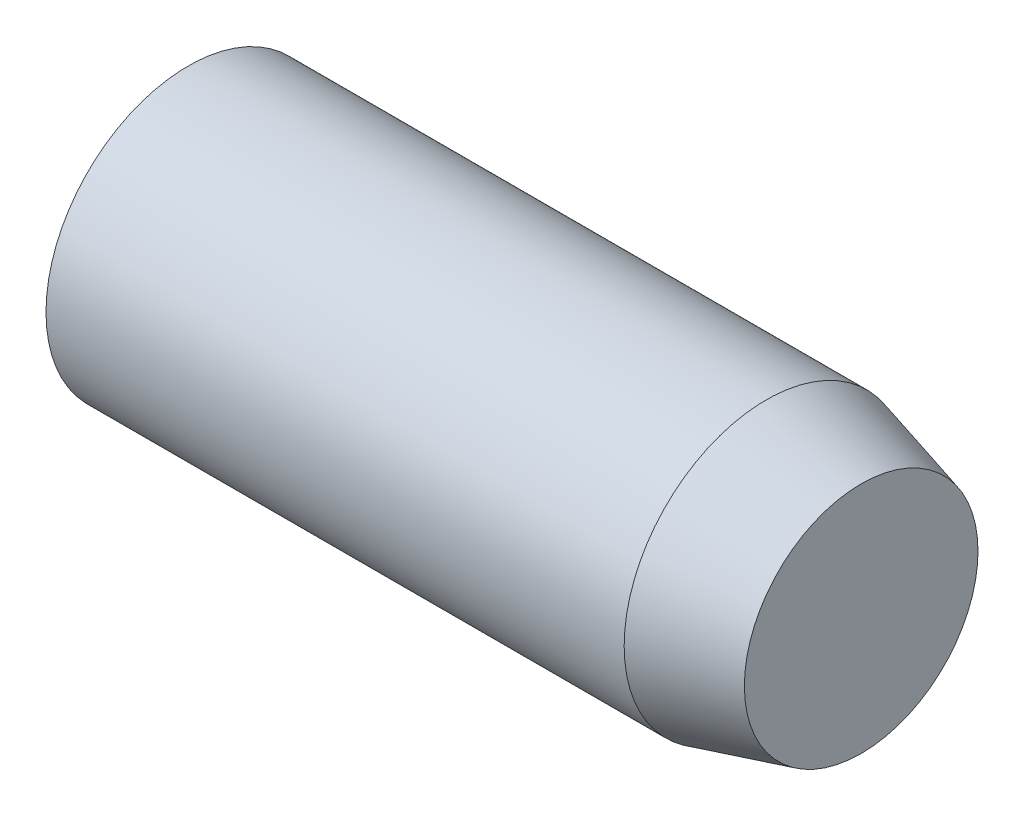
ISO-10303-21;
HEADER;
FILE_DESCRIPTION(('STEP AP214'),'2;1');
FILE_NAME('part.step','',(''),(''),'','','');
FILE_SCHEMA(('AUTOMOTIVE_DESIGN { 1 0 10303 214 1 1 1 1 }'));
ENDSEC;
DATA;
#1=APPLICATION_CONTEXT('core data for automotive mechanical design processes');
#2=APPLICATION_PROTOCOL_DEFINITION('international standard','automotive_design',2000,#1);
#3=PRODUCT_CONTEXT('',#1,'mechanical');
#4=PRODUCT('Part','Part','',(#3));
#5=PRODUCT_RELATED_PRODUCT_CATEGORY('part','',(#4));
#6=PRODUCT_DEFINITION_FORMATION('','',#4);
#7=PRODUCT_DEFINITION_CONTEXT('part definition',#1,'design');
#8=PRODUCT_DEFINITION('design','',#6,#7);
#9=PRODUCT_DEFINITION_SHAPE('','',#8);
#10=(LENGTH_UNIT() NAMED_UNIT(*) SI_UNIT(.MILLI.,.METRE.));
#11=(NAMED_UNIT(*) PLANE_ANGLE_UNIT() SI_UNIT($,.RADIAN.));
#12=(NAMED_UNIT(*) SI_UNIT($,.STERADIAN.) SOLID_ANGLE_UNIT());
#13=UNCERTAINTY_MEASURE_WITH_UNIT(LENGTH_MEASURE(1.E-05),#10,'distance_accuracy_value','');
#14=(GEOMETRIC_REPRESENTATION_CONTEXT(3) GLOBAL_UNCERTAINTY_ASSIGNED_CONTEXT((#13)) GLOBAL_UNIT_ASSIGNED_CONTEXT((#10,
#11,#12)) REPRESENTATION_CONTEXT('',''));
#15=CARTESIAN_POINT('',(0.,0.,0.));
#16=DIRECTION('',(0.,0.,1.));
#17=DIRECTION('',(1.,0.,0.));
#18=AXIS2_PLACEMENT_3D('',#15,#16,#17);
#19=CARTESIAN_POINT('',(0.,0.,0.));
#20=DIRECTION('',(-1.,0.,0.));
#21=DIRECTION('',(0.,0.,1.));
#22=AXIS2_PLACEMENT_3D('',#19,#20,#21);
#23=PLANE('',#22);
#24=CARTESIAN_POINT('',(0.,0.,0.));
#25=DIRECTION('',(-1.,0.,0.));
#26=DIRECTION('',(0.,0.,1.));
#27=AXIS2_PLACEMENT_3D('',#24,#25,#26);
#28=CIRCLE('',#27,2.46410161517474);
#29=CARTESIAN_POINT('',(0.,0.,2.46410161517474));
#30=VERTEX_POINT('',#29);
#31=EDGE_CURVE('E19',#30,#30,#28,.T.);
#32=ORIENTED_EDGE('',*,*,#31,.F.);
#33=EDGE_LOOP('',(#32));
#34=FACE_BOUND('',#33,.T.);
#35=ADVANCED_FACE('F16',(#34),#23,.F.);
#36=CARTESIAN_POINT('',(-2.00000000000955,0.,0.));
#37=DIRECTION('',(-1.,0.,0.));
#38=DIRECTION('',(0.,0.,1.));
#39=AXIS2_PLACEMENT_3D('',#36,#37,#38);
#40=CONICAL_SURFACE('',#39,3.00000000001432,0.261799387787384);
#41=CARTESIAN_POINT('',(-2.,0.,0.));
#42=DIRECTION('',(-1.,0.,0.));
#43=DIRECTION('',(0.,0.,1.));
#44=AXIS2_PLACEMENT_3D('',#41,#42,#43);
#45=CIRCLE('',#44,3.);
#46=CARTESIAN_POINT('',(-2.,0.,3.));
#47=VERTEX_POINT('',#46);
#48=EDGE_CURVE('E23',#47,#47,#45,.T.);
#49=ORIENTED_EDGE('',*,*,#48,.F.);
#50=EDGE_LOOP('',(#49));
#51=FACE_BOUND('',#50,.T.);
#52=ORIENTED_EDGE('',*,*,#31,.T.);
#53=EDGE_LOOP('',(#52));
#54=FACE_BOUND('',#53,.T.);
#55=ADVANCED_FACE('F35',(#51,#54),#40,.T.);
#56=CARTESIAN_POINT('',(-9.,0.,0.));
#57=DIRECTION('',(0.,1.,0.));
#58=DIRECTION('',(1.,0.,0.));
#59=AXIS2_PLACEMENT_3D('',#56,#57,#58);
#60=SPHERICAL_SURFACE('',#59,6.);
#61=CARTESIAN_POINT('',(-14.1961524227066,0.,0.));
#62=DIRECTION('',(-1.,0.,0.));
#63=DIRECTION('',(0.,0.,1.));
#64=AXIS2_PLACEMENT_3D('',#61,#62,#63);
#65=CIRCLE('',#64,3.);
#66=CARTESIAN_POINT('',(-14.1961524227066,0.,3.));
#67=VERTEX_POINT('',#66);
#68=EDGE_CURVE('E10',#67,#67,#65,.F.);
#69=ORIENTED_EDGE('',*,*,#68,.F.);
#70=EDGE_LOOP('',(#69));
#71=FACE_BOUND('',#70,.T.);
#72=ADVANCED_FACE('F31',(#71),#60,.T.);
#73=CARTESIAN_POINT('',(-108.489956820223,0.,0.));
#74=DIRECTION('',(-1.,0.,0.));
#75=DIRECTION('',(0.,0.,1.));
#76=AXIS2_PLACEMENT_3D('',#73,#74,#75);
#77=CYLINDRICAL_SURFACE('',#76,3.);
#78=ORIENTED_EDGE('',*,*,#68,.T.);
#79=EDGE_LOOP('',(#78));
#80=FACE_BOUND('',#79,.T.);
#81=ORIENTED_EDGE('',*,*,#48,.T.);
#82=EDGE_LOOP('',(#81));
#83=FACE_BOUND('',#82,.T.);
#84=ADVANCED_FACE('F34',(#80,#83),#77,.T.);
#85=CLOSED_SHELL('',(#35,#55,#72,#84));
#86=MANIFOLD_SOLID_BREP('B1',#85);
#87=ADVANCED_BREP_SHAPE_REPRESENTATION('',(#18,#86),#14);
#88=SHAPE_DEFINITION_REPRESENTATION(#9,#87);
ENDSEC;
END-ISO-10303-21;
